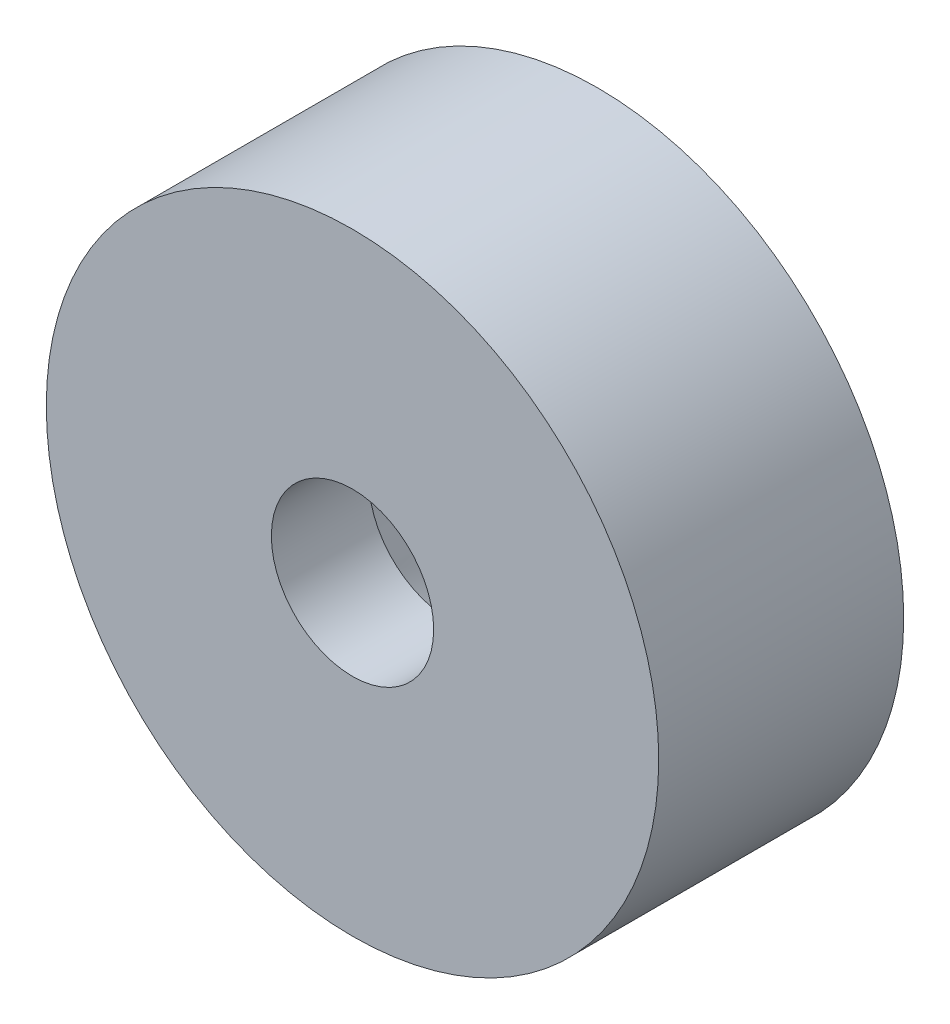
ISO-10303-21;
HEADER;
FILE_DESCRIPTION(('STEP AP214'),'2;1');
FILE_NAME('part.step','',(''),(''),'','','');
FILE_SCHEMA(('AUTOMOTIVE_DESIGN { 1 0 10303 214 1 1 1 1 }'));
ENDSEC;
DATA;
#1=APPLICATION_CONTEXT('core data for automotive mechanical design processes');
#2=APPLICATION_PROTOCOL_DEFINITION('international standard','automotive_design',2000,#1);
#3=PRODUCT_CONTEXT('',#1,'mechanical');
#4=PRODUCT('Part','Part','',(#3));
#5=PRODUCT_RELATED_PRODUCT_CATEGORY('part','',(#4));
#6=PRODUCT_DEFINITION_FORMATION('','',#4);
#7=PRODUCT_DEFINITION_CONTEXT('part definition',#1,'design');
#8=PRODUCT_DEFINITION('design','',#6,#7);
#9=PRODUCT_DEFINITION_SHAPE('','',#8);
#10=(LENGTH_UNIT() NAMED_UNIT(*) SI_UNIT(.MILLI.,.METRE.));
#11=(NAMED_UNIT(*) PLANE_ANGLE_UNIT() SI_UNIT($,.RADIAN.));
#12=(NAMED_UNIT(*) SI_UNIT($,.STERADIAN.) SOLID_ANGLE_UNIT());
#13=UNCERTAINTY_MEASURE_WITH_UNIT(LENGTH_MEASURE(1.E-05),#10,'distance_accuracy_value','');
#14=(GEOMETRIC_REPRESENTATION_CONTEXT(3) GLOBAL_UNCERTAINTY_ASSIGNED_CONTEXT((#13)) GLOBAL_UNIT_ASSIGNED_CONTEXT((#10,
#11,#12)) REPRESENTATION_CONTEXT('',''));
#15=CARTESIAN_POINT('',(0.,0.,0.));
#16=DIRECTION('',(0.,0.,1.));
#17=DIRECTION('',(1.,0.,0.));
#18=AXIS2_PLACEMENT_3D('',#15,#16,#17);
#19=CARTESIAN_POINT('',(0.,0.,8.));
#20=DIRECTION('',(0.,0.,-1.));
#21=DIRECTION('',(-1.,0.,0.));
#22=AXIS2_PLACEMENT_3D('',#19,#20,#21);
#23=CYLINDRICAL_SURFACE('',#22,10.);
#24=CARTESIAN_POINT('',(0.,0.,8.));
#25=DIRECTION('',(0.,0.,1.));
#26=DIRECTION('',(1.,0.,0.));
#27=AXIS2_PLACEMENT_3D('',#24,#25,#26);
#28=CIRCLE('',#27,10.);
#29=CARTESIAN_POINT('',(10.,0.,8.));
#30=VERTEX_POINT('',#29);
#31=EDGE_CURVE('E10',#30,#30,#28,.T.);
#32=ORIENTED_EDGE('',*,*,#31,.F.);
#33=EDGE_LOOP('',(#32));
#34=FACE_BOUND('',#33,.T.);
#35=CARTESIAN_POINT('',(0.,0.,0.));
#36=DIRECTION('',(0.,0.,1.));
#37=DIRECTION('',(1.,0.,0.));
#38=AXIS2_PLACEMENT_3D('',#35,#36,#37);
#39=CIRCLE('',#38,10.);
#40=CARTESIAN_POINT('',(10.,0.,0.));
#41=VERTEX_POINT('',#40);
#42=EDGE_CURVE('E38',#41,#41,#39,.T.);
#43=ORIENTED_EDGE('',*,*,#42,.T.);
#44=EDGE_LOOP('',(#43));
#45=FACE_BOUND('',#44,.T.);
#46=ADVANCED_FACE('F31',(#34,#45),#23,.T.);
#47=CARTESIAN_POINT('',(0.,0.,8.));
#48=DIRECTION('',(0.,0.,1.));
#49=DIRECTION('',(1.,0.,0.));
#50=AXIS2_PLACEMENT_3D('',#47,#48,#49);
#51=PLANE('',#50);
#52=CARTESIAN_POINT('',(0.,0.,8.));
#53=DIRECTION('',(0.,0.,1.));
#54=DIRECTION('',(1.,0.,0.));
#55=AXIS2_PLACEMENT_3D('',#52,#53,#54);
#56=CIRCLE('',#55,2.65);
#57=CARTESIAN_POINT('',(2.65,0.,8.));
#58=VERTEX_POINT('',#57);
#59=EDGE_CURVE('E43',#58,#58,#56,.F.);
#60=ORIENTED_EDGE('',*,*,#59,.T.);
#61=EDGE_LOOP('',(#60));
#62=FACE_BOUND('',#61,.T.);
#63=ORIENTED_EDGE('',*,*,#31,.T.);
#64=EDGE_LOOP('',(#63));
#65=FACE_BOUND('',#64,.T.);
#66=ADVANCED_FACE('F66',(#62,#65),#51,.T.);
#67=CARTESIAN_POINT('',(0.,0.,0.));
#68=DIRECTION('',(0.,0.,1.));
#69=DIRECTION('',(1.,0.,0.));
#70=AXIS2_PLACEMENT_3D('',#67,#68,#69);
#71=PLANE('',#70);
#72=CARTESIAN_POINT('',(0.,0.,0.));
#73=DIRECTION('',(0.,0.,-1.));
#74=DIRECTION('',(-1.,0.,0.));
#75=AXIS2_PLACEMENT_3D('',#72,#73,#74);
#76=CIRCLE('',#75,5.);
#77=CARTESIAN_POINT('',(-5.,0.,0.));
#78=VERTEX_POINT('',#77);
#79=EDGE_CURVE('E47',#78,#78,#76,.T.);
#80=ORIENTED_EDGE('',*,*,#79,.F.);
#81=EDGE_LOOP('',(#80));
#82=FACE_BOUND('',#81,.T.);
#83=ORIENTED_EDGE('',*,*,#42,.F.);
#84=EDGE_LOOP('',(#83));
#85=FACE_BOUND('',#84,.T.);
#86=ADVANCED_FACE('F63',(#82,#85),#71,.F.);
#87=CARTESIAN_POINT('',(0.,0.,15.4953318805774));
#88=DIRECTION('',(0.,0.,-1.));
#89=DIRECTION('',(-1.,0.,0.));
#90=AXIS2_PLACEMENT_3D('',#87,#88,#89);
#91=CYLINDRICAL_SURFACE('',#90,2.65);
#92=CARTESIAN_POINT('',(0.,0.,4.81821402771134));
#93=DIRECTION('',(0.,0.,-1.));
#94=DIRECTION('',(-1.,0.,0.));
#95=AXIS2_PLACEMENT_3D('',#92,#93,#94);
#96=CIRCLE('',#95,2.65);
#97=CARTESIAN_POINT('',(-2.65,0.,4.81821402771134));
#98=VERTEX_POINT('',#97);
#99=EDGE_CURVE('E34',#98,#98,#96,.T.);
#100=ORIENTED_EDGE('',*,*,#99,.T.);
#101=EDGE_LOOP('',(#100));
#102=FACE_BOUND('',#101,.T.);
#103=ORIENTED_EDGE('',*,*,#59,.F.);
#104=EDGE_LOOP('',(#103));
#105=FACE_BOUND('',#104,.T.);
#106=ADVANCED_FACE('F54',(#102,#105),#91,.F.);
#107=CARTESIAN_POINT('',(0.,0.,0.));
#108=DIRECTION('',(0.,0.,-1.));
#109=DIRECTION('',(-1.,0.,0.));
#110=AXIS2_PLACEMENT_3D('',#107,#108,#109);
#111=CONICAL_SURFACE('',#110,5.,0.453785605518526);
#112=ORIENTED_EDGE('',*,*,#79,.T.);
#113=EDGE_LOOP('',(#112));
#114=FACE_BOUND('',#113,.T.);
#115=ORIENTED_EDGE('',*,*,#99,.F.);
#116=EDGE_LOOP('',(#115));
#117=FACE_BOUND('',#116,.T.);
#118=ADVANCED_FACE('F57',(#114,#117),#111,.F.);
#119=CLOSED_SHELL('',(#46,#66,#86,#106,#118));
#120=MANIFOLD_SOLID_BREP('B2',#119);
#121=ADVANCED_BREP_SHAPE_REPRESENTATION('',(#18,#120),#14);
#122=SHAPE_DEFINITION_REPRESENTATION(#9,#121);
ENDSEC;
END-ISO-10303-21;
